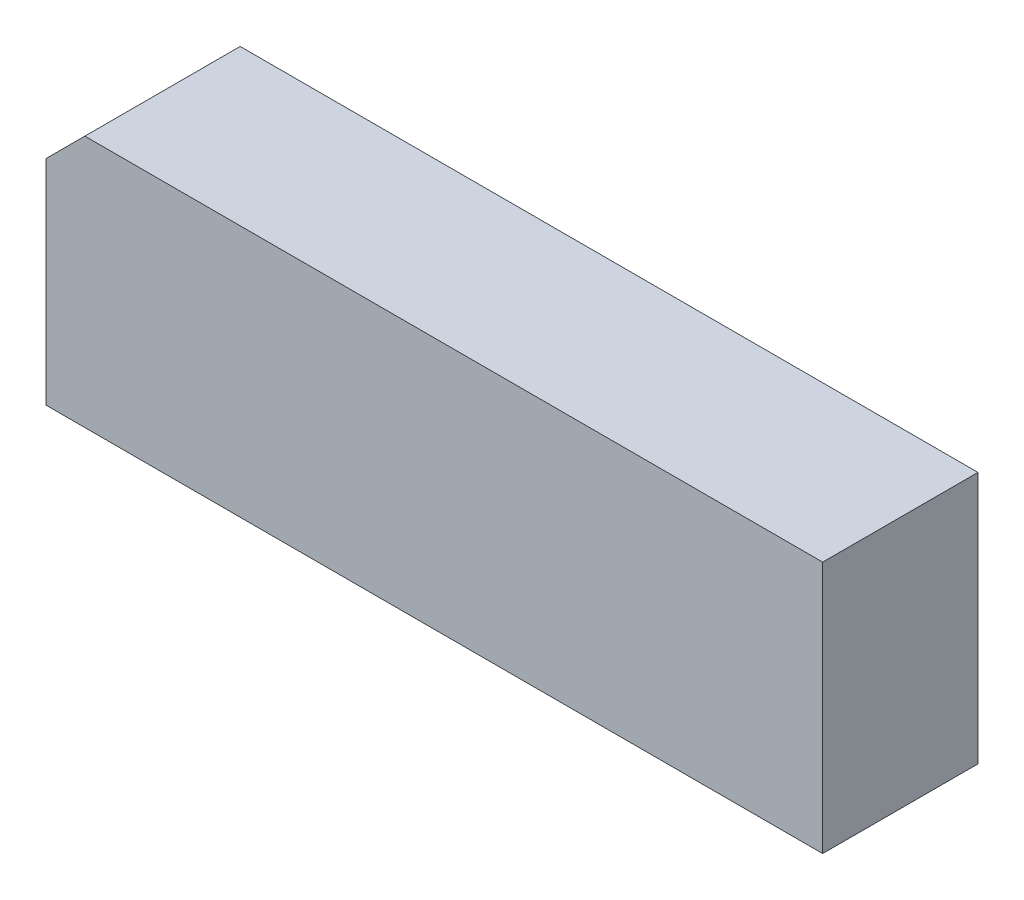
ISO-10303-21;
HEADER;
FILE_DESCRIPTION(('STEP AP214'),'2;1');
FILE_NAME('part.step','',(''),(''),'','','');
FILE_SCHEMA(('AUTOMOTIVE_DESIGN { 1 0 10303 214 1 1 1 1 }'));
ENDSEC;
DATA;
#1=APPLICATION_CONTEXT('core data for automotive mechanical design processes');
#2=APPLICATION_PROTOCOL_DEFINITION('international standard','automotive_design',2000,#1);
#3=PRODUCT_CONTEXT('',#1,'mechanical');
#4=PRODUCT('Part','Part','',(#3));
#5=PRODUCT_RELATED_PRODUCT_CATEGORY('part','',(#4));
#6=PRODUCT_DEFINITION_FORMATION('','',#4);
#7=PRODUCT_DEFINITION_CONTEXT('part definition',#1,'design');
#8=PRODUCT_DEFINITION('design','',#6,#7);
#9=PRODUCT_DEFINITION_SHAPE('','',#8);
#10=(LENGTH_UNIT() NAMED_UNIT(*) SI_UNIT(.MILLI.,.METRE.));
#11=(NAMED_UNIT(*) PLANE_ANGLE_UNIT() SI_UNIT($,.RADIAN.));
#12=(NAMED_UNIT(*) SI_UNIT($,.STERADIAN.) SOLID_ANGLE_UNIT());
#13=UNCERTAINTY_MEASURE_WITH_UNIT(LENGTH_MEASURE(1.E-05),#10,'distance_accuracy_value','');
#14=(GEOMETRIC_REPRESENTATION_CONTEXT(3) GLOBAL_UNCERTAINTY_ASSIGNED_CONTEXT((#13)) GLOBAL_UNIT_ASSIGNED_CONTEXT((#10,
#11,#12)) REPRESENTATION_CONTEXT('',''));
#15=CARTESIAN_POINT('',(0.,0.,0.));
#16=DIRECTION('',(0.,0.,1.));
#17=DIRECTION('',(1.,0.,0.));
#18=AXIS2_PLACEMENT_3D('',#15,#16,#17);
#19=CARTESIAN_POINT('',(0.,0.,4.));
#20=DIRECTION('',(1.,0.,0.));
#21=DIRECTION('',(0.,0.,-1.));
#22=AXIS2_PLACEMENT_3D('',#19,#20,#21);
#23=PLANE('',#22);
#24=DIRECTION('',(0.,-1.,0.));
#25=VECTOR('',#24,1.);
#26=CARTESIAN_POINT('',(0.,0.,0.));
#27=LINE('',#26,#25);
#28=CARTESIAN_POINT('',(0.,5.5,0.));
#29=VERTEX_POINT('',#28);
#30=CARTESIAN_POINT('',(0.,0.,0.));
#31=VERTEX_POINT('',#30);
#32=EDGE_CURVE('E107',#29,#31,#27,.T.);
#33=ORIENTED_EDGE('',*,*,#32,.T.);
#34=DIRECTION('',(0.,0.,-1.));
#35=VECTOR('',#34,1.);
#36=CARTESIAN_POINT('',(0.,0.,4.));
#37=LINE('',#36,#35);
#38=CARTESIAN_POINT('',(0.,0.,4.));
#39=VERTEX_POINT('',#38);
#40=EDGE_CURVE('E11',#39,#31,#37,.T.);
#41=ORIENTED_EDGE('',*,*,#40,.F.);
#42=DIRECTION('',(0.,-1.,0.));
#43=VECTOR('',#42,1.);
#44=CARTESIAN_POINT('',(0.,0.,4.));
#45=LINE('',#44,#43);
#46=CARTESIAN_POINT('',(0.,5.5,4.));
#47=VERTEX_POINT('',#46);
#48=EDGE_CURVE('E115',#47,#39,#45,.T.);
#49=ORIENTED_EDGE('',*,*,#48,.F.);
#50=DIRECTION('',(0.,0.,-1.));
#51=VECTOR('',#50,1.);
#52=CARTESIAN_POINT('',(0.,5.5,4.));
#53=LINE('',#52,#51);
#54=EDGE_CURVE('E103',#47,#29,#53,.T.);
#55=ORIENTED_EDGE('',*,*,#54,.T.);
#56=EDGE_LOOP('',(#33,#41,#49,#55));
#57=FACE_BOUND('',#56,.T.);
#58=ADVANCED_FACE('F33',(#57),#23,.F.);
#59=CARTESIAN_POINT('',(0.,0.,4.));
#60=DIRECTION('',(0.,1.,0.));
#61=DIRECTION('',(0.,0.,1.));
#62=AXIS2_PLACEMENT_3D('',#59,#60,#61);
#63=PLANE('',#62);
#64=DIRECTION('',(1.,0.,0.));
#65=VECTOR('',#64,1.);
#66=CARTESIAN_POINT('',(0.,0.,0.));
#67=LINE('',#66,#65);
#68=CARTESIAN_POINT('',(20.,0.,0.));
#69=VERTEX_POINT('',#68);
#70=EDGE_CURVE('E110',#31,#69,#67,.T.);
#71=ORIENTED_EDGE('',*,*,#70,.T.);
#72=DIRECTION('',(0.,0.,-1.));
#73=VECTOR('',#72,1.);
#74=CARTESIAN_POINT('',(20.,0.,4.));
#75=LINE('',#74,#73);
#76=CARTESIAN_POINT('',(20.,0.,4.));
#77=VERTEX_POINT('',#76);
#78=EDGE_CURVE('E41',#77,#69,#75,.T.);
#79=ORIENTED_EDGE('',*,*,#78,.F.);
#80=DIRECTION('',(1.,0.,0.));
#81=VECTOR('',#80,1.);
#82=CARTESIAN_POINT('',(0.,0.,4.));
#83=LINE('',#82,#81);
#84=EDGE_CURVE('E83',#39,#77,#83,.T.);
#85=ORIENTED_EDGE('',*,*,#84,.F.);
#86=ORIENTED_EDGE('',*,*,#40,.T.);
#87=EDGE_LOOP('',(#71,#79,#85,#86));
#88=FACE_BOUND('',#87,.T.);
#89=ADVANCED_FACE('F134',(#88),#63,.F.);
#90=CARTESIAN_POINT('',(20.,0.,4.));
#91=DIRECTION('',(-1.,0.,0.));
#92=DIRECTION('',(0.,0.,1.));
#93=AXIS2_PLACEMENT_3D('',#90,#91,#92);
#94=PLANE('',#93);
#95=DIRECTION('',(0.,1.,0.));
#96=VECTOR('',#95,1.);
#97=CARTESIAN_POINT('',(20.,0.,0.));
#98=LINE('',#97,#96);
#99=CARTESIAN_POINT('',(20.,6.5,0.));
#100=VERTEX_POINT('',#99);
#101=EDGE_CURVE('E98',#69,#100,#98,.T.);
#102=ORIENTED_EDGE('',*,*,#101,.T.);
#103=DIRECTION('',(0.,0.,-1.));
#104=VECTOR('',#103,1.);
#105=CARTESIAN_POINT('',(20.,6.5,4.));
#106=LINE('',#105,#104);
#107=CARTESIAN_POINT('',(20.,6.5,4.));
#108=VERTEX_POINT('',#107);
#109=EDGE_CURVE('E95',#108,#100,#106,.T.);
#110=ORIENTED_EDGE('',*,*,#109,.F.);
#111=DIRECTION('',(0.,1.,0.));
#112=VECTOR('',#111,1.);
#113=CARTESIAN_POINT('',(20.,0.,4.));
#114=LINE('',#113,#112);
#115=EDGE_CURVE('E87',#77,#108,#114,.T.);
#116=ORIENTED_EDGE('',*,*,#115,.F.);
#117=ORIENTED_EDGE('',*,*,#78,.T.);
#118=EDGE_LOOP('',(#102,#110,#116,#117));
#119=FACE_BOUND('',#118,.T.);
#120=ADVANCED_FACE('F96',(#119),#94,.F.);
#121=CARTESIAN_POINT('',(0.999999999999997,6.5,4.));
#122=DIRECTION('',(0.,-1.,0.));
#123=DIRECTION('',(0.,0.,-1.));
#124=AXIS2_PLACEMENT_3D('',#121,#122,#123);
#125=PLANE('',#124);
#126=DIRECTION('',(-1.,0.,0.));
#127=VECTOR('',#126,1.);
#128=CARTESIAN_POINT('',(0.999999999999997,6.5,0.));
#129=LINE('',#128,#127);
#130=CARTESIAN_POINT('',(0.999999999999997,6.5,0.));
#131=VERTEX_POINT('',#130);
#132=EDGE_CURVE('E69',#100,#131,#129,.T.);
#133=ORIENTED_EDGE('',*,*,#132,.T.);
#134=DIRECTION('',(0.,0.,-1.));
#135=VECTOR('',#134,1.);
#136=CARTESIAN_POINT('',(0.999999999999997,6.5,4.));
#137=LINE('',#136,#135);
#138=CARTESIAN_POINT('',(0.999999999999997,6.5,4.));
#139=VERTEX_POINT('',#138);
#140=EDGE_CURVE('E99',#139,#131,#137,.T.);
#141=ORIENTED_EDGE('',*,*,#140,.F.);
#142=DIRECTION('',(-1.,0.,0.));
#143=VECTOR('',#142,1.);
#144=CARTESIAN_POINT('',(0.999999999999997,6.5,4.));
#145=LINE('',#144,#143);
#146=EDGE_CURVE('E91',#108,#139,#145,.T.);
#147=ORIENTED_EDGE('',*,*,#146,.F.);
#148=ORIENTED_EDGE('',*,*,#109,.T.);
#149=EDGE_LOOP('',(#133,#141,#147,#148));
#150=FACE_BOUND('',#149,.T.);
#151=ADVANCED_FACE('F101',(#150),#125,.F.);
#152=CARTESIAN_POINT('',(0.,5.5,4.));
#153=DIRECTION('',(0.707106781186549,-0.707106781186546,0.));
#154=DIRECTION('',(0.707106781186546,0.707106781186549,0.));
#155=AXIS2_PLACEMENT_3D('',#152,#153,#154);
#156=PLANE('',#155);
#157=DIRECTION('',(-0.707106781186546,-0.707106781186549,0.));
#158=VECTOR('',#157,1.);
#159=CARTESIAN_POINT('',(0.,5.5,0.));
#160=LINE('',#159,#158);
#161=EDGE_CURVE('E75',#131,#29,#160,.T.);
#162=ORIENTED_EDGE('',*,*,#161,.T.);
#163=ORIENTED_EDGE('',*,*,#54,.F.);
#164=DIRECTION('',(-0.707106781186546,-0.707106781186549,0.));
#165=VECTOR('',#164,1.);
#166=CARTESIAN_POINT('',(0.,5.5,4.));
#167=LINE('',#166,#165);
#168=EDGE_CURVE('E49',#139,#47,#167,.T.);
#169=ORIENTED_EDGE('',*,*,#168,.F.);
#170=ORIENTED_EDGE('',*,*,#140,.T.);
#171=EDGE_LOOP('',(#162,#163,#169,#170));
#172=FACE_BOUND('',#171,.T.);
#173=ADVANCED_FACE('F123',(#172),#156,.F.);
#174=CARTESIAN_POINT('',(0.,0.,4.));
#175=DIRECTION('',(0.,0.,-1.));
#176=DIRECTION('',(-1.,0.,0.));
#177=AXIS2_PLACEMENT_3D('',#174,#175,#176);
#178=PLANE('',#177);
#179=ORIENTED_EDGE('',*,*,#48,.T.);
#180=ORIENTED_EDGE('',*,*,#84,.T.);
#181=ORIENTED_EDGE('',*,*,#115,.T.);
#182=ORIENTED_EDGE('',*,*,#146,.T.);
#183=ORIENTED_EDGE('',*,*,#168,.T.);
#184=EDGE_LOOP('',(#179,#180,#181,#182,#183));
#185=FACE_BOUND('',#184,.T.);
#186=ADVANCED_FACE('F89',(#185),#178,.F.);
#187=CARTESIAN_POINT('',(0.,0.,0.));
#188=DIRECTION('',(0.,0.,-1.));
#189=DIRECTION('',(-1.,0.,0.));
#190=AXIS2_PLACEMENT_3D('',#187,#188,#189);
#191=PLANE('',#190);
#192=ORIENTED_EDGE('',*,*,#32,.F.);
#193=ORIENTED_EDGE('',*,*,#161,.F.);
#194=ORIENTED_EDGE('',*,*,#132,.F.);
#195=ORIENTED_EDGE('',*,*,#101,.F.);
#196=ORIENTED_EDGE('',*,*,#70,.F.);
#197=EDGE_LOOP('',(#192,#193,#194,#195,#196));
#198=FACE_BOUND('',#197,.T.);
#199=ADVANCED_FACE('F119',(#198),#191,.T.);
#200=CLOSED_SHELL('',(#58,#89,#120,#151,#173,#186,#199));
#201=MANIFOLD_SOLID_BREP('B2',#200);
#202=ADVANCED_BREP_SHAPE_REPRESENTATION('',(#18,#201),#14);
#203=SHAPE_DEFINITION_REPRESENTATION(#9,#202);
ENDSEC;
END-ISO-10303-21;
